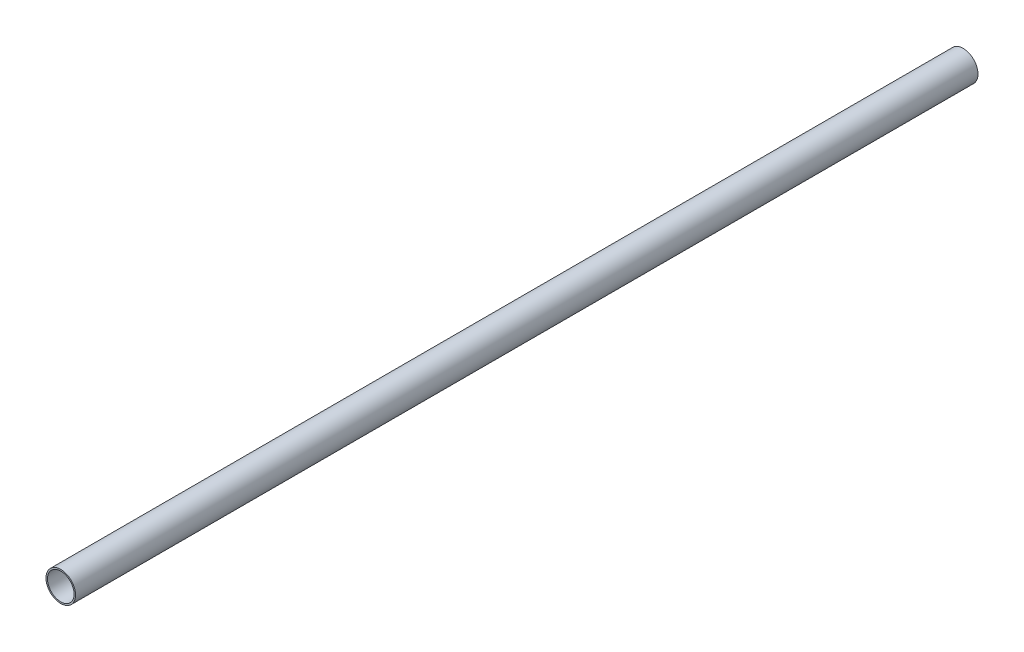
ISO-10303-21;
HEADER;
FILE_DESCRIPTION(('STEP AP214'),'2;1');
FILE_NAME('part.step','',(''),(''),'','','');
FILE_SCHEMA(('AUTOMOTIVE_DESIGN { 1 0 10303 214 1 1 1 1 }'));
ENDSEC;
DATA;
#1=APPLICATION_CONTEXT('core data for automotive mechanical design processes');
#2=APPLICATION_PROTOCOL_DEFINITION('international standard','automotive_design',2000,#1);
#3=PRODUCT_CONTEXT('',#1,'mechanical');
#4=PRODUCT('Part','Part','',(#3));
#5=PRODUCT_RELATED_PRODUCT_CATEGORY('part','',(#4));
#6=PRODUCT_DEFINITION_FORMATION('','',#4);
#7=PRODUCT_DEFINITION_CONTEXT('part definition',#1,'design');
#8=PRODUCT_DEFINITION('design','',#6,#7);
#9=PRODUCT_DEFINITION_SHAPE('','',#8);
#10=(LENGTH_UNIT() NAMED_UNIT(*) SI_UNIT(.MILLI.,.METRE.));
#11=(NAMED_UNIT(*) PLANE_ANGLE_UNIT() SI_UNIT($,.RADIAN.));
#12=(NAMED_UNIT(*) SI_UNIT($,.STERADIAN.) SOLID_ANGLE_UNIT());
#13=UNCERTAINTY_MEASURE_WITH_UNIT(LENGTH_MEASURE(1.E-05),#10,'distance_accuracy_value','');
#14=(GEOMETRIC_REPRESENTATION_CONTEXT(3) GLOBAL_UNCERTAINTY_ASSIGNED_CONTEXT((#13)) GLOBAL_UNIT_ASSIGNED_CONTEXT((#10,
#11,#12)) REPRESENTATION_CONTEXT('',''));
#15=CARTESIAN_POINT('',(0.,0.,0.));
#16=DIRECTION('',(0.,0.,1.));
#17=DIRECTION('',(1.,0.,0.));
#18=AXIS2_PLACEMENT_3D('',#15,#16,#17);
#19=CARTESIAN_POINT('',(0.,0.,774.7));
#20=DIRECTION('',(0.,0.,1.));
#21=DIRECTION('',(1.,0.,0.));
#22=AXIS2_PLACEMENT_3D('',#19,#20,#21);
#23=PLANE('',#22);
#24=CARTESIAN_POINT('',(0.,0.,774.7));
#25=DIRECTION('',(0.,0.,1.));
#26=DIRECTION('',(1.,0.,0.));
#27=AXIS2_PLACEMENT_3D('',#24,#25,#26);
#28=CIRCLE('',#27,12.7);
#29=CARTESIAN_POINT('',(12.7,0.,774.7));
#30=VERTEX_POINT('',#29);
#31=EDGE_CURVE('E10',#30,#30,#28,.T.);
#32=ORIENTED_EDGE('',*,*,#31,.T.);
#33=EDGE_LOOP('',(#32));
#34=FACE_BOUND('',#33,.T.);
#35=CARTESIAN_POINT('',(0.,0.,774.7));
#36=DIRECTION('',(0.,0.,1.));
#37=DIRECTION('',(1.,0.,0.));
#38=AXIS2_PLACEMENT_3D('',#35,#36,#37);
#39=CIRCLE('',#38,11.43);
#40=CARTESIAN_POINT('',(11.43,0.,774.7));
#41=VERTEX_POINT('',#40);
#42=EDGE_CURVE('E42',#41,#41,#39,.T.);
#43=ORIENTED_EDGE('',*,*,#42,.F.);
#44=EDGE_LOOP('',(#43));
#45=FACE_BOUND('',#44,.T.);
#46=ADVANCED_FACE('F31',(#34,#45),#23,.T.);
#47=CARTESIAN_POINT('',(0.,0.,0.));
#48=DIRECTION('',(0.,0.,1.));
#49=DIRECTION('',(1.,0.,0.));
#50=AXIS2_PLACEMENT_3D('',#47,#48,#49);
#51=PLANE('',#50);
#52=CARTESIAN_POINT('',(0.,0.,0.));
#53=DIRECTION('',(0.,0.,1.));
#54=DIRECTION('',(1.,0.,0.));
#55=AXIS2_PLACEMENT_3D('',#52,#53,#54);
#56=CIRCLE('',#55,12.7);
#57=CARTESIAN_POINT('',(12.7,0.,0.));
#58=VERTEX_POINT('',#57);
#59=EDGE_CURVE('E35',#58,#58,#56,.T.);
#60=ORIENTED_EDGE('',*,*,#59,.F.);
#61=EDGE_LOOP('',(#60));
#62=FACE_BOUND('',#61,.T.);
#63=CARTESIAN_POINT('',(0.,0.,0.));
#64=DIRECTION('',(0.,0.,1.));
#65=DIRECTION('',(1.,0.,0.));
#66=AXIS2_PLACEMENT_3D('',#63,#64,#65);
#67=CIRCLE('',#66,11.43);
#68=CARTESIAN_POINT('',(11.43,0.,0.));
#69=VERTEX_POINT('',#68);
#70=EDGE_CURVE('E44',#69,#69,#67,.T.);
#71=ORIENTED_EDGE('',*,*,#70,.T.);
#72=EDGE_LOOP('',(#71));
#73=FACE_BOUND('',#72,.T.);
#74=ADVANCED_FACE('F54',(#62,#73),#51,.F.);
#75=CARTESIAN_POINT('',(0.,0.,774.7));
#76=DIRECTION('',(0.,0.,-1.));
#77=DIRECTION('',(-1.,0.,0.));
#78=AXIS2_PLACEMENT_3D('',#75,#76,#77);
#79=CYLINDRICAL_SURFACE('',#78,12.7);
#80=ORIENTED_EDGE('',*,*,#31,.F.);
#81=EDGE_LOOP('',(#80));
#82=FACE_BOUND('',#81,.T.);
#83=ORIENTED_EDGE('',*,*,#59,.T.);
#84=EDGE_LOOP('',(#83));
#85=FACE_BOUND('',#84,.T.);
#86=ADVANCED_FACE('F33',(#82,#85),#79,.T.);
#87=CARTESIAN_POINT('',(0.,0.,774.7));
#88=DIRECTION('',(0.,0.,-1.));
#89=DIRECTION('',(-1.,0.,0.));
#90=AXIS2_PLACEMENT_3D('',#87,#88,#89);
#91=CYLINDRICAL_SURFACE('',#90,11.43);
#92=ORIENTED_EDGE('',*,*,#42,.T.);
#93=EDGE_LOOP('',(#92));
#94=FACE_BOUND('',#93,.T.);
#95=ORIENTED_EDGE('',*,*,#70,.F.);
#96=EDGE_LOOP('',(#95));
#97=FACE_BOUND('',#96,.T.);
#98=ADVANCED_FACE('F50',(#94,#97),#91,.F.);
#99=CLOSED_SHELL('',(#46,#74,#86,#98));
#100=MANIFOLD_SOLID_BREP('B2',#99);
#101=ADVANCED_BREP_SHAPE_REPRESENTATION('',(#18,#100),#14);
#102=SHAPE_DEFINITION_REPRESENTATION(#9,#101);
ENDSEC;
END-ISO-10303-21;
